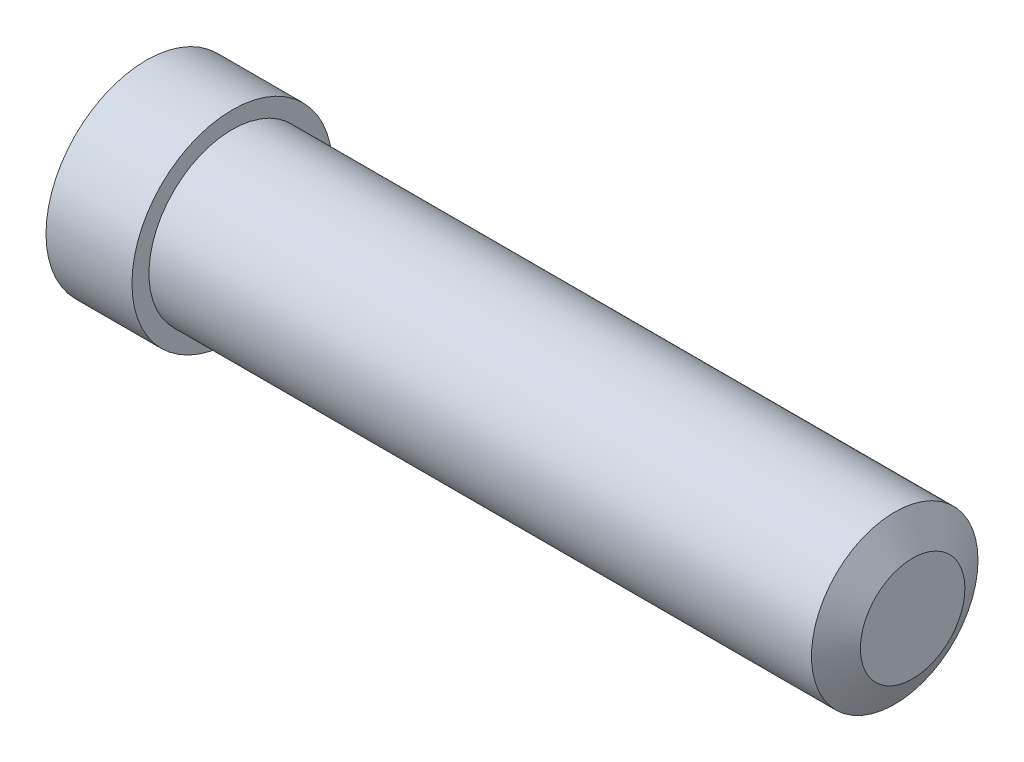
ISO-10303-21;
HEADER;
FILE_DESCRIPTION(('STEP AP214'),'2;1');
FILE_NAME('part.step','',(''),(''),'','','');
FILE_SCHEMA(('AUTOMOTIVE_DESIGN { 1 0 10303 214 1 1 1 1 }'));
ENDSEC;
DATA;
#1=APPLICATION_CONTEXT('core data for automotive mechanical design processes');
#2=APPLICATION_PROTOCOL_DEFINITION('international standard','automotive_design',2000,#1);
#3=PRODUCT_CONTEXT('',#1,'mechanical');
#4=PRODUCT('Part','Part','',(#3));
#5=PRODUCT_RELATED_PRODUCT_CATEGORY('part','',(#4));
#6=PRODUCT_DEFINITION_FORMATION('','',#4);
#7=PRODUCT_DEFINITION_CONTEXT('part definition',#1,'design');
#8=PRODUCT_DEFINITION('design','',#6,#7);
#9=PRODUCT_DEFINITION_SHAPE('','',#8);
#10=(LENGTH_UNIT() NAMED_UNIT(*) SI_UNIT(.MILLI.,.METRE.));
#11=(NAMED_UNIT(*) PLANE_ANGLE_UNIT() SI_UNIT($,.RADIAN.));
#12=(NAMED_UNIT(*) SI_UNIT($,.STERADIAN.) SOLID_ANGLE_UNIT());
#13=UNCERTAINTY_MEASURE_WITH_UNIT(LENGTH_MEASURE(1.E-05),#10,'distance_accuracy_value','');
#14=(GEOMETRIC_REPRESENTATION_CONTEXT(3) GLOBAL_UNCERTAINTY_ASSIGNED_CONTEXT((#13)) GLOBAL_UNIT_ASSIGNED_CONTEXT((#10,
#11,#12)) REPRESENTATION_CONTEXT('',''));
#15=CARTESIAN_POINT('',(0.,0.,0.));
#16=DIRECTION('',(0.,0.,1.));
#17=DIRECTION('',(1.,0.,0.));
#18=AXIS2_PLACEMENT_3D('',#15,#16,#17);
#19=CARTESIAN_POINT('',(1.2192,0.,0.));
#20=DIRECTION('',(1.,0.,0.));
#21=DIRECTION('',(0.,0.,-1.));
#22=AXIS2_PLACEMENT_3D('',#19,#20,#21);
#23=PLANE('',#22);
#24=CARTESIAN_POINT('',(1.2192,0.,0.));
#25=DIRECTION('',(1.,0.,0.));
#26=DIRECTION('',(0.,0.,-1.));
#27=AXIS2_PLACEMENT_3D('',#24,#25,#26);
#28=CIRCLE('',#27,1.4224);
#29=CARTESIAN_POINT('',(1.2192,0.,-1.4224));
#30=VERTEX_POINT('',#29);
#31=EDGE_CURVE('E41',#30,#30,#28,.T.);
#32=ORIENTED_EDGE('',*,*,#31,.T.);
#33=EDGE_LOOP('',(#32));
#34=FACE_BOUND('',#33,.T.);
#35=CARTESIAN_POINT('',(1.2192,0.,0.));
#36=DIRECTION('',(1.,0.,0.));
#37=DIRECTION('',(0.,0.,-1.));
#38=AXIS2_PLACEMENT_3D('',#35,#36,#37);
#39=CIRCLE('',#38,1.1811);
#40=CARTESIAN_POINT('',(1.2192,0.,-1.1811));
#41=VERTEX_POINT('',#40);
#42=EDGE_CURVE('E49',#41,#41,#39,.T.);
#43=ORIENTED_EDGE('',*,*,#42,.F.);
#44=EDGE_LOOP('',(#43));
#45=FACE_BOUND('',#44,.T.);
#46=ADVANCED_FACE('F30',(#34,#45),#23,.T.);
#47=CARTESIAN_POINT('',(1.2192,0.,0.));
#48=DIRECTION('',(-1.,0.,0.));
#49=DIRECTION('',(0.,0.,1.));
#50=AXIS2_PLACEMENT_3D('',#47,#48,#49);
#51=CYLINDRICAL_SURFACE('',#50,1.4224);
#52=ORIENTED_EDGE('',*,*,#31,.F.);
#53=EDGE_LOOP('',(#52));
#54=FACE_BOUND('',#53,.T.);
#55=CARTESIAN_POINT('',(0.,0.,0.));
#56=DIRECTION('',(1.,0.,0.));
#57=DIRECTION('',(0.,0.,-1.));
#58=AXIS2_PLACEMENT_3D('',#55,#56,#57);
#59=CIRCLE('',#58,1.4224);
#60=CARTESIAN_POINT('',(0.,0.,-1.4224));
#61=VERTEX_POINT('',#60);
#62=EDGE_CURVE('E45',#61,#61,#59,.T.);
#63=ORIENTED_EDGE('',*,*,#62,.T.);
#64=EDGE_LOOP('',(#63));
#65=FACE_BOUND('',#64,.T.);
#66=ADVANCED_FACE('F57',(#54,#65),#51,.T.);
#67=CARTESIAN_POINT('',(0.,0.,0.));
#68=DIRECTION('',(1.,0.,0.));
#69=DIRECTION('',(0.,0.,-1.));
#70=AXIS2_PLACEMENT_3D('',#67,#68,#69);
#71=PLANE('',#70);
#72=ORIENTED_EDGE('',*,*,#62,.F.);
#73=EDGE_LOOP('',(#72));
#74=FACE_BOUND('',#73,.T.);
#75=ADVANCED_FACE('F63',(#74),#71,.F.);
#76=CARTESIAN_POINT('',(10.8712,0.,0.));
#77=DIRECTION('',(-1.,0.,0.));
#78=DIRECTION('',(0.,0.,1.));
#79=AXIS2_PLACEMENT_3D('',#76,#77,#78);
#80=CYLINDRICAL_SURFACE('',#79,1.1811);
#81=CARTESIAN_POINT('',(10.6172,0.,0.));
#82=DIRECTION('',(1.,0.,0.));
#83=DIRECTION('',(0.,0.,-1.));
#84=AXIS2_PLACEMENT_3D('',#81,#82,#83);
#85=CIRCLE('',#84,1.1811);
#86=CARTESIAN_POINT('',(10.6172,0.,-1.1811));
#87=VERTEX_POINT('',#86);
#88=EDGE_CURVE('E10',#87,#87,#85,.F.);
#89=ORIENTED_EDGE('',*,*,#88,.T.);
#90=EDGE_LOOP('',(#89));
#91=FACE_BOUND('',#90,.T.);
#92=ORIENTED_EDGE('',*,*,#42,.T.);
#93=EDGE_LOOP('',(#92));
#94=FACE_BOUND('',#93,.T.);
#95=ADVANCED_FACE('F54',(#91,#94),#80,.T.);
#96=CARTESIAN_POINT('',(10.8712,0.,0.));
#97=DIRECTION('',(1.,0.,0.));
#98=DIRECTION('',(0.,0.,-1.));
#99=AXIS2_PLACEMENT_3D('',#96,#97,#98);
#100=PLANE('',#99);
#101=CARTESIAN_POINT('',(10.8712,0.,0.));
#102=DIRECTION('',(1.,0.,0.));
#103=DIRECTION('',(0.,0.,-1.));
#104=AXIS2_PLACEMENT_3D('',#101,#102,#103);
#105=CIRCLE('',#104,0.741159094877505);
#106=CARTESIAN_POINT('',(10.8712,0.,-0.741159094877505));
#107=VERTEX_POINT('',#106);
#108=EDGE_CURVE('E37',#107,#107,#105,.T.);
#109=ORIENTED_EDGE('',*,*,#108,.T.);
#110=EDGE_LOOP('',(#109));
#111=FACE_BOUND('',#110,.T.);
#112=ADVANCED_FACE('F73',(#111),#100,.T.);
#113=CARTESIAN_POINT('',(10.8712,0.,0.));
#114=DIRECTION('',(-1.,0.,0.));
#115=DIRECTION('',(0.,0.,1.));
#116=AXIS2_PLACEMENT_3D('',#113,#114,#115);
#117=CONICAL_SURFACE('',#116,0.741159094877505,1.0471975511966);
#118=ORIENTED_EDGE('',*,*,#88,.F.);
#119=EDGE_LOOP('',(#118));
#120=FACE_BOUND('',#119,.T.);
#121=ORIENTED_EDGE('',*,*,#108,.F.);
#122=EDGE_LOOP('',(#121));
#123=FACE_BOUND('',#122,.T.);
#124=ADVANCED_FACE('F32',(#120,#123),#117,.T.);
#125=CLOSED_SHELL('',(#46,#66,#75,#95,#112,#124));
#126=MANIFOLD_SOLID_BREP('B2',#125);
#127=ADVANCED_BREP_SHAPE_REPRESENTATION('',(#18,#126),#14);
#128=SHAPE_DEFINITION_REPRESENTATION(#9,#127);
ENDSEC;
END-ISO-10303-21;
